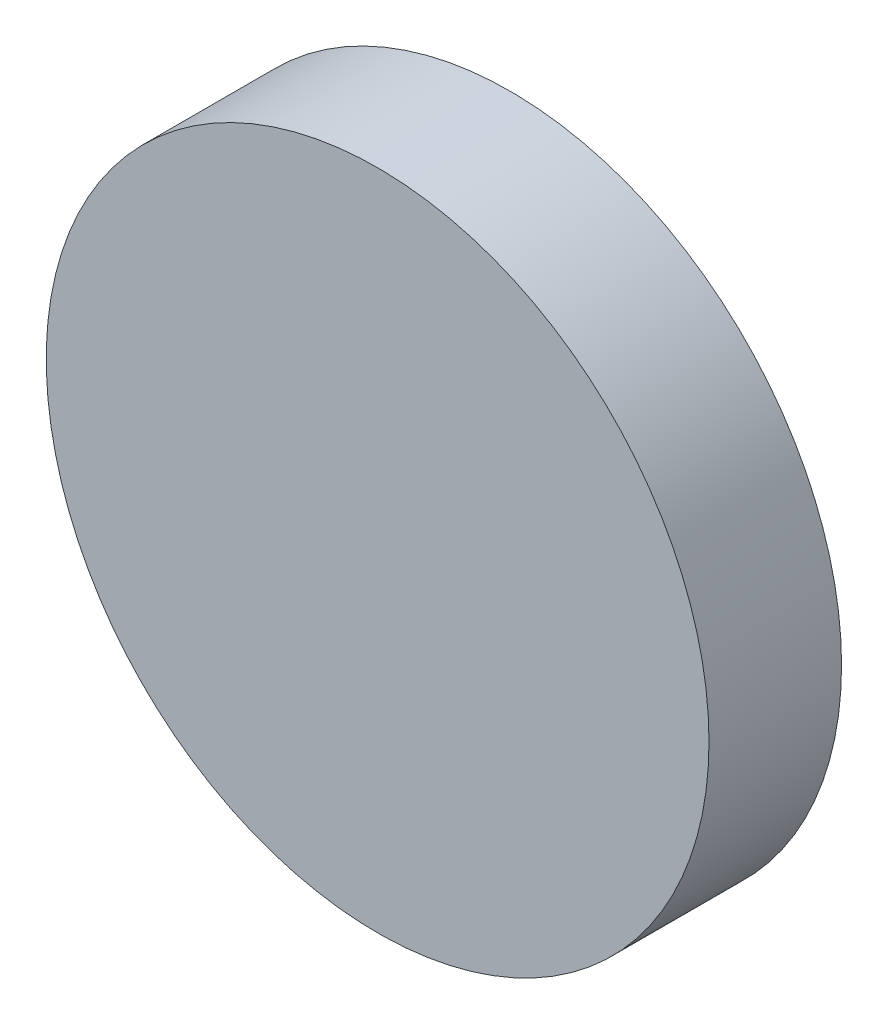
ISO-10303-21;
HEADER;
FILE_DESCRIPTION(('STEP AP214'),'2;1');
FILE_NAME('part.step','',(''),(''),'','','');
FILE_SCHEMA(('AUTOMOTIVE_DESIGN { 1 0 10303 214 1 1 1 1 }'));
ENDSEC;
DATA;
#1=APPLICATION_CONTEXT('core data for automotive mechanical design processes');
#2=APPLICATION_PROTOCOL_DEFINITION('international standard','automotive_design',2000,#1);
#3=PRODUCT_CONTEXT('',#1,'mechanical');
#4=PRODUCT('Part','Part','',(#3));
#5=PRODUCT_RELATED_PRODUCT_CATEGORY('part','',(#4));
#6=PRODUCT_DEFINITION_FORMATION('','',#4);
#7=PRODUCT_DEFINITION_CONTEXT('part definition',#1,'design');
#8=PRODUCT_DEFINITION('design','',#6,#7);
#9=PRODUCT_DEFINITION_SHAPE('','',#8);
#10=(LENGTH_UNIT() NAMED_UNIT(*) SI_UNIT(.MILLI.,.METRE.));
#11=(NAMED_UNIT(*) PLANE_ANGLE_UNIT() SI_UNIT($,.RADIAN.));
#12=(NAMED_UNIT(*) SI_UNIT($,.STERADIAN.) SOLID_ANGLE_UNIT());
#13=UNCERTAINTY_MEASURE_WITH_UNIT(LENGTH_MEASURE(1.E-05),#10,'distance_accuracy_value','');
#14=(GEOMETRIC_REPRESENTATION_CONTEXT(3) GLOBAL_UNCERTAINTY_ASSIGNED_CONTEXT((#13)) GLOBAL_UNIT_ASSIGNED_CONTEXT((#10,
#11,#12)) REPRESENTATION_CONTEXT('',''));
#15=CARTESIAN_POINT('',(0.,0.,0.));
#16=DIRECTION('',(0.,0.,1.));
#17=DIRECTION('',(1.,0.,0.));
#18=AXIS2_PLACEMENT_3D('',#15,#16,#17);
#19=CARTESIAN_POINT('',(0.,0.,4.));
#20=DIRECTION('',(0.,0.,-1.));
#21=DIRECTION('',(-1.,0.,0.));
#22=AXIS2_PLACEMENT_3D('',#19,#20,#21);
#23=CYLINDRICAL_SURFACE('',#22,10.);
#24=CARTESIAN_POINT('',(0.,0.,4.));
#25=DIRECTION('',(0.,0.,1.));
#26=DIRECTION('',(1.,0.,0.));
#27=AXIS2_PLACEMENT_3D('',#24,#25,#26);
#28=CIRCLE('',#27,10.);
#29=CARTESIAN_POINT('',(10.,0.,4.));
#30=VERTEX_POINT('',#29);
#31=EDGE_CURVE('E10',#30,#30,#28,.T.);
#32=ORIENTED_EDGE('',*,*,#31,.F.);
#33=EDGE_LOOP('',(#32));
#34=FACE_BOUND('',#33,.T.);
#35=CARTESIAN_POINT('',(0.,0.,0.));
#36=DIRECTION('',(0.,0.,1.));
#37=DIRECTION('',(1.,0.,0.));
#38=AXIS2_PLACEMENT_3D('',#35,#36,#37);
#39=CIRCLE('',#38,10.);
#40=CARTESIAN_POINT('',(10.,0.,0.));
#41=VERTEX_POINT('',#40);
#42=EDGE_CURVE('E38',#41,#41,#39,.T.);
#43=ORIENTED_EDGE('',*,*,#42,.T.);
#44=EDGE_LOOP('',(#43));
#45=FACE_BOUND('',#44,.T.);
#46=ADVANCED_FACE('F35',(#34,#45),#23,.T.);
#47=CARTESIAN_POINT('',(0.,0.,4.));
#48=DIRECTION('',(0.,0.,1.));
#49=DIRECTION('',(1.,0.,0.));
#50=AXIS2_PLACEMENT_3D('',#47,#48,#49);
#51=PLANE('',#50);
#52=ORIENTED_EDGE('',*,*,#31,.T.);
#53=EDGE_LOOP('',(#52));
#54=FACE_BOUND('',#53,.T.);
#55=ADVANCED_FACE('F50',(#54),#51,.T.);
#56=CARTESIAN_POINT('',(0.,0.,0.));
#57=DIRECTION('',(0.,0.,1.));
#58=DIRECTION('',(1.,0.,0.));
#59=AXIS2_PLACEMENT_3D('',#56,#57,#58);
#60=PLANE('',#59);
#61=ORIENTED_EDGE('',*,*,#42,.F.);
#62=EDGE_LOOP('',(#61));
#63=FACE_BOUND('',#62,.T.);
#64=ADVANCED_FACE('F48',(#63),#60,.F.);
#65=CLOSED_SHELL('',(#46,#55,#64));
#66=MANIFOLD_SOLID_BREP('B2',#65);
#67=ADVANCED_BREP_SHAPE_REPRESENTATION('',(#18,#66),#14);
#68=SHAPE_DEFINITION_REPRESENTATION(#9,#67);
ENDSEC;
END-ISO-10303-21;
